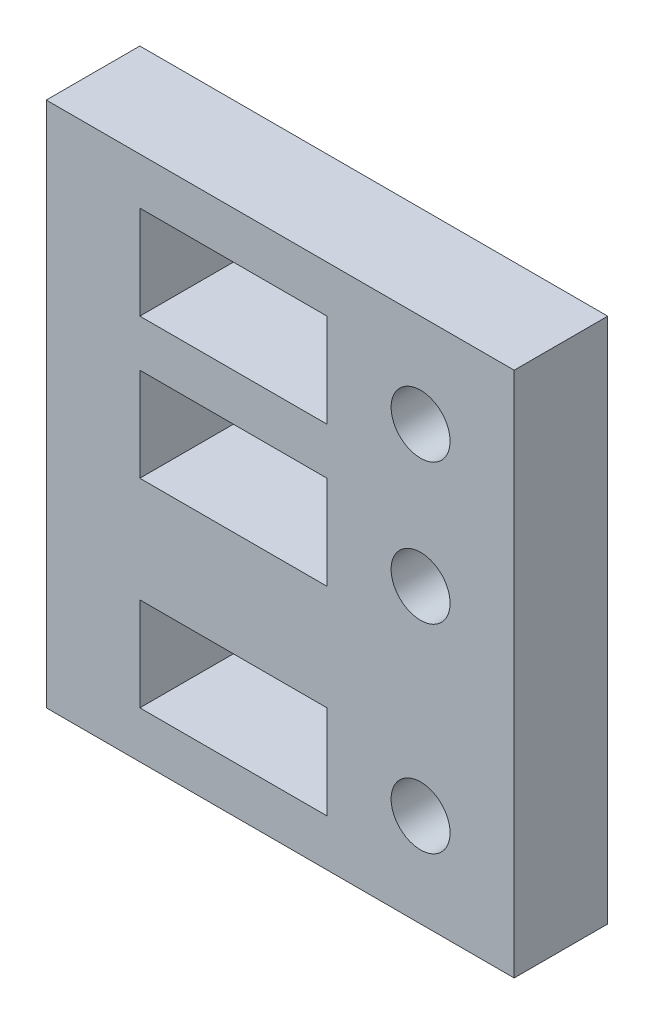
ISO-10303-21;
HEADER;
FILE_DESCRIPTION(('STEP AP214'),'2;1');
FILE_NAME('part.step','',(''),(''),'','','');
FILE_SCHEMA(('AUTOMOTIVE_DESIGN { 1 0 10303 214 1 1 1 1 }'));
ENDSEC;
DATA;
#1=APPLICATION_CONTEXT('core data for automotive mechanical design processes');
#2=APPLICATION_PROTOCOL_DEFINITION('international standard','automotive_design',2000,#1);
#3=PRODUCT_CONTEXT('',#1,'mechanical');
#4=PRODUCT('Part','Part','',(#3));
#5=PRODUCT_RELATED_PRODUCT_CATEGORY('part','',(#4));
#6=PRODUCT_DEFINITION_FORMATION('','',#4);
#7=PRODUCT_DEFINITION_CONTEXT('part definition',#1,'design');
#8=PRODUCT_DEFINITION('design','',#6,#7);
#9=PRODUCT_DEFINITION_SHAPE('','',#8);
#10=(LENGTH_UNIT() NAMED_UNIT(*) SI_UNIT(.MILLI.,.METRE.));
#11=(NAMED_UNIT(*) PLANE_ANGLE_UNIT() SI_UNIT($,.RADIAN.));
#12=(NAMED_UNIT(*) SI_UNIT($,.STERADIAN.) SOLID_ANGLE_UNIT());
#13=UNCERTAINTY_MEASURE_WITH_UNIT(LENGTH_MEASURE(1.E-05),#10,'distance_accuracy_value','');
#14=(GEOMETRIC_REPRESENTATION_CONTEXT(3) GLOBAL_UNCERTAINTY_ASSIGNED_CONTEXT((#13)) GLOBAL_UNIT_ASSIGNED_CONTEXT((#10,
#11,#12)) REPRESENTATION_CONTEXT('',''));
#15=CARTESIAN_POINT('',(0.,0.,0.));
#16=DIRECTION('',(0.,0.,1.));
#17=DIRECTION('',(1.,0.,0.));
#18=AXIS2_PLACEMENT_3D('',#15,#16,#17);
#19=CARTESIAN_POINT('',(0.,0.,-6.35));
#20=DIRECTION('',(0.,0.,1.));
#21=DIRECTION('',(-1.,0.,0.));
#22=AXIS2_PLACEMENT_3D('',#19,#20,#21);
#23=PLANE('',#22);
#24=CARTESIAN_POINT('',(25.4,6.35,-6.35));
#25=DIRECTION('',(0.,0.,1.));
#26=DIRECTION('',(1.,0.,0.));
#27=AXIS2_PLACEMENT_3D('',#24,#25,#26);
#28=CIRCLE('',#27,2.);
#29=CARTESIAN_POINT('',(27.4,6.35,-6.35));
#30=VERTEX_POINT('',#29);
#31=EDGE_CURVE('E187',#30,#30,#28,.T.);
#32=ORIENTED_EDGE('',*,*,#31,.T.);
#33=EDGE_LOOP('',(#32));
#34=FACE_BOUND('',#33,.T.);
#35=CARTESIAN_POINT('',(25.4,19.84375,-6.35));
#36=DIRECTION('',(0.,0.,1.));
#37=DIRECTION('',(1.,0.,0.));
#38=AXIS2_PLACEMENT_3D('',#35,#36,#37);
#39=CIRCLE('',#38,2.);
#40=CARTESIAN_POINT('',(27.4,19.84375,-6.35));
#41=VERTEX_POINT('',#40);
#42=EDGE_CURVE('E193',#41,#41,#39,.T.);
#43=ORIENTED_EDGE('',*,*,#42,.T.);
#44=EDGE_LOOP('',(#43));
#45=FACE_BOUND('',#44,.T.);
#46=DIRECTION('',(0.,-1.,0.));
#47=VECTOR('',#46,1.);
#48=CARTESIAN_POINT('',(6.35,9.525,-6.35));
#49=LINE('',#48,#47);
#50=CARTESIAN_POINT('',(6.35,9.525,-6.35));
#51=VERTEX_POINT('',#50);
#52=CARTESIAN_POINT('',(6.35,3.175,-6.35));
#53=VERTEX_POINT('',#52);
#54=EDGE_CURVE('E199',#51,#53,#49,.T.);
#55=ORIENTED_EDGE('',*,*,#54,.T.);
#56=DIRECTION('',(1.,0.,0.));
#57=VECTOR('',#56,1.);
#58=CARTESIAN_POINT('',(6.35,3.175,-6.35));
#59=LINE('',#58,#57);
#60=CARTESIAN_POINT('',(19.05,3.175,-6.35));
#61=VERTEX_POINT('',#60);
#62=EDGE_CURVE('E202',#53,#61,#59,.T.);
#63=ORIENTED_EDGE('',*,*,#62,.T.);
#64=DIRECTION('',(0.,1.,0.));
#65=VECTOR('',#64,1.);
#66=CARTESIAN_POINT('',(19.05,9.525,-6.35));
#67=LINE('',#66,#65);
#68=CARTESIAN_POINT('',(19.05,9.525,-6.35));
#69=VERTEX_POINT('',#68);
#70=EDGE_CURVE('E206',#61,#69,#67,.T.);
#71=ORIENTED_EDGE('',*,*,#70,.T.);
#72=DIRECTION('',(-1.,0.,0.));
#73=VECTOR('',#72,1.);
#74=CARTESIAN_POINT('',(6.35,9.525,-6.35));
#75=LINE('',#74,#73);
#76=EDGE_CURVE('E209',#69,#51,#75,.T.);
#77=ORIENTED_EDGE('',*,*,#76,.T.);
#78=EDGE_LOOP('',(#55,#63,#71,#77));
#79=FACE_BOUND('',#78,.T.);
#80=DIRECTION('',(0.,-1.,0.));
#81=VECTOR('',#80,1.);
#82=CARTESIAN_POINT('',(0.,0.,-6.35));
#83=LINE('',#82,#81);
#84=CARTESIAN_POINT('',(0.,35.71875,-6.35));
#85=VERTEX_POINT('',#84);
#86=CARTESIAN_POINT('',(0.,0.,-6.35));
#87=VERTEX_POINT('',#86);
#88=EDGE_CURVE('E263',#85,#87,#83,.T.);
#89=ORIENTED_EDGE('',*,*,#88,.F.);
#90=DIRECTION('',(-1.,0.,0.));
#91=VECTOR('',#90,1.);
#92=CARTESIAN_POINT('',(0.,35.71875,-6.35));
#93=LINE('',#92,#91);
#94=CARTESIAN_POINT('',(31.75,35.71875,-6.35));
#95=VERTEX_POINT('',#94);
#96=EDGE_CURVE('E273',#95,#85,#93,.T.);
#97=ORIENTED_EDGE('',*,*,#96,.F.);
#98=DIRECTION('',(0.,1.,0.));
#99=VECTOR('',#98,1.);
#100=CARTESIAN_POINT('',(31.75,0.,-6.35));
#101=LINE('',#100,#99);
#102=CARTESIAN_POINT('',(31.75,0.,-6.35));
#103=VERTEX_POINT('',#102);
#104=EDGE_CURVE('E270',#103,#95,#101,.T.);
#105=ORIENTED_EDGE('',*,*,#104,.F.);
#106=DIRECTION('',(1.,0.,0.));
#107=VECTOR('',#106,1.);
#108=CARTESIAN_POINT('',(0.,0.,-6.35));
#109=LINE('',#108,#107);
#110=EDGE_CURVE('E266',#87,#103,#109,.T.);
#111=ORIENTED_EDGE('',*,*,#110,.F.);
#112=EDGE_LOOP('',(#89,#97,#105,#111));
#113=FACE_BOUND('',#112,.T.);
#114=DIRECTION('',(0.,-1.,0.));
#115=VECTOR('',#114,1.);
#116=CARTESIAN_POINT('',(6.35,23.01875,-6.35));
#117=LINE('',#116,#115);
#118=CARTESIAN_POINT('',(6.35,23.01875,-6.35));
#119=VERTEX_POINT('',#118);
#120=CARTESIAN_POINT('',(6.35,16.66875,-6.35));
#121=VERTEX_POINT('',#120);
#122=EDGE_CURVE('E231',#119,#121,#117,.T.);
#123=ORIENTED_EDGE('',*,*,#122,.T.);
#124=DIRECTION('',(1.,0.,0.));
#125=VECTOR('',#124,1.);
#126=CARTESIAN_POINT('',(6.35,16.66875,-6.35));
#127=LINE('',#126,#125);
#128=CARTESIAN_POINT('',(19.05,16.66875,-6.35));
#129=VERTEX_POINT('',#128);
#130=EDGE_CURVE('E234',#121,#129,#127,.T.);
#131=ORIENTED_EDGE('',*,*,#130,.T.);
#132=DIRECTION('',(0.,1.,0.));
#133=VECTOR('',#132,1.);
#134=CARTESIAN_POINT('',(19.05,23.01875,-6.35));
#135=LINE('',#134,#133);
#136=CARTESIAN_POINT('',(19.05,23.01875,-6.35));
#137=VERTEX_POINT('',#136);
#138=EDGE_CURVE('E238',#129,#137,#135,.T.);
#139=ORIENTED_EDGE('',*,*,#138,.T.);
#140=DIRECTION('',(-1.,0.,0.));
#141=VECTOR('',#140,1.);
#142=CARTESIAN_POINT('',(6.35,23.01875,-6.35));
#143=LINE('',#142,#141);
#144=EDGE_CURVE('E241',#137,#119,#143,.T.);
#145=ORIENTED_EDGE('',*,*,#144,.T.);
#146=EDGE_LOOP('',(#123,#131,#139,#145));
#147=FACE_BOUND('',#146,.T.);
#148=DIRECTION('',(0.,1.,0.));
#149=VECTOR('',#148,1.);
#150=CARTESIAN_POINT('',(19.05,26.19375,-6.35));
#151=LINE('',#150,#149);
#152=CARTESIAN_POINT('',(19.05,26.19375,-6.35));
#153=VERTEX_POINT('',#152);
#154=CARTESIAN_POINT('',(19.05,32.54375,-6.35));
#155=VERTEX_POINT('',#154);
#156=EDGE_CURVE('E150',#153,#155,#151,.T.);
#157=ORIENTED_EDGE('',*,*,#156,.T.);
#158=DIRECTION('',(-1.,0.,0.));
#159=VECTOR('',#158,1.);
#160=CARTESIAN_POINT('',(6.35,32.54375,-6.35));
#161=LINE('',#160,#159);
#162=CARTESIAN_POINT('',(6.35,32.54375,-6.35));
#163=VERTEX_POINT('',#162);
#164=EDGE_CURVE('E159',#155,#163,#161,.T.);
#165=ORIENTED_EDGE('',*,*,#164,.T.);
#166=DIRECTION('',(0.,-1.,0.));
#167=VECTOR('',#166,1.);
#168=CARTESIAN_POINT('',(6.35,26.19375,-6.35));
#169=LINE('',#168,#167);
#170=CARTESIAN_POINT('',(6.35,26.19375,-6.35));
#171=VERTEX_POINT('',#170);
#172=EDGE_CURVE('E163',#163,#171,#169,.T.);
#173=ORIENTED_EDGE('',*,*,#172,.T.);
#174=DIRECTION('',(1.,0.,0.));
#175=VECTOR('',#174,1.);
#176=CARTESIAN_POINT('',(19.05,26.19375,-6.35));
#177=LINE('',#176,#175);
#178=EDGE_CURVE('E167',#171,#153,#177,.T.);
#179=ORIENTED_EDGE('',*,*,#178,.T.);
#180=EDGE_LOOP('',(#157,#165,#173,#179));
#181=FACE_BOUND('',#180,.T.);
#182=CARTESIAN_POINT('',(25.4,29.36875,-6.35));
#183=DIRECTION('',(0.,0.,1.));
#184=DIRECTION('',(1.,0.,0.));
#185=AXIS2_PLACEMENT_3D('',#182,#183,#184);
#186=CIRCLE('',#185,2.);
#187=CARTESIAN_POINT('',(27.4,29.36875,-6.35));
#188=VERTEX_POINT('',#187);
#189=EDGE_CURVE('E181',#188,#188,#186,.T.);
#190=ORIENTED_EDGE('',*,*,#189,.T.);
#191=EDGE_LOOP('',(#190));
#192=FACE_BOUND('',#191,.T.);
#193=ADVANCED_FACE('F35',(#34,#45,#79,#113,#147,#181,#192),#23,.F.);
#194=CARTESIAN_POINT('',(0.,0.,0.));
#195=DIRECTION('',(0.,0.,1.));
#196=DIRECTION('',(-1.,0.,0.));
#197=AXIS2_PLACEMENT_3D('',#194,#195,#196);
#198=PLANE('',#197);
#199=DIRECTION('',(1.,0.,0.));
#200=VECTOR('',#199,1.);
#201=CARTESIAN_POINT('',(19.05,26.19375,0.));
#202=LINE('',#201,#200);
#203=CARTESIAN_POINT('',(6.35,26.19375,0.));
#204=VERTEX_POINT('',#203);
#205=CARTESIAN_POINT('',(19.05,26.19375,0.));
#206=VERTEX_POINT('',#205);
#207=EDGE_CURVE('E168',#204,#206,#202,.T.);
#208=ORIENTED_EDGE('',*,*,#207,.F.);
#209=DIRECTION('',(0.,-1.,0.));
#210=VECTOR('',#209,1.);
#211=CARTESIAN_POINT('',(6.35,26.19375,0.));
#212=LINE('',#211,#210);
#213=CARTESIAN_POINT('',(6.35,32.54375,0.));
#214=VERTEX_POINT('',#213);
#215=EDGE_CURVE('E171',#214,#204,#212,.T.);
#216=ORIENTED_EDGE('',*,*,#215,.F.);
#217=DIRECTION('',(-1.,0.,0.));
#218=VECTOR('',#217,1.);
#219=CARTESIAN_POINT('',(6.35,32.54375,0.));
#220=LINE('',#219,#218);
#221=CARTESIAN_POINT('',(19.05,32.54375,0.));
#222=VERTEX_POINT('',#221);
#223=EDGE_CURVE('E180',#222,#214,#220,.T.);
#224=ORIENTED_EDGE('',*,*,#223,.F.);
#225=DIRECTION('',(0.,1.,0.));
#226=VECTOR('',#225,1.);
#227=CARTESIAN_POINT('',(19.05,26.19375,0.));
#228=LINE('',#227,#226);
#229=EDGE_CURVE('E151',#206,#222,#228,.T.);
#230=ORIENTED_EDGE('',*,*,#229,.F.);
#231=EDGE_LOOP('',(#208,#216,#224,#230));
#232=FACE_BOUND('',#231,.T.);
#233=CARTESIAN_POINT('',(25.4,6.35,0.));
#234=DIRECTION('',(0.,0.,1.));
#235=DIRECTION('',(1.,0.,0.));
#236=AXIS2_PLACEMENT_3D('',#233,#234,#235);
#237=CIRCLE('',#236,2.);
#238=CARTESIAN_POINT('',(27.4,6.35,0.));
#239=VERTEX_POINT('',#238);
#240=EDGE_CURVE('E155',#239,#239,#237,.T.);
#241=ORIENTED_EDGE('',*,*,#240,.F.);
#242=EDGE_LOOP('',(#241));
#243=FACE_BOUND('',#242,.T.);
#244=DIRECTION('',(-1.,0.,0.));
#245=VECTOR('',#244,1.);
#246=CARTESIAN_POINT('',(6.35,9.525,0.));
#247=LINE('',#246,#245);
#248=CARTESIAN_POINT('',(19.05,9.525,0.));
#249=VERTEX_POINT('',#248);
#250=CARTESIAN_POINT('',(6.35,9.525,0.));
#251=VERTEX_POINT('',#250);
#252=EDGE_CURVE('E203',#249,#251,#247,.T.);
#253=ORIENTED_EDGE('',*,*,#252,.F.);
#254=DIRECTION('',(0.,1.,0.));
#255=VECTOR('',#254,1.);
#256=CARTESIAN_POINT('',(19.05,9.525,0.));
#257=LINE('',#256,#255);
#258=CARTESIAN_POINT('',(19.05,3.175,0.));
#259=VERTEX_POINT('',#258);
#260=EDGE_CURVE('E218',#259,#249,#257,.T.);
#261=ORIENTED_EDGE('',*,*,#260,.F.);
#262=DIRECTION('',(1.,0.,0.));
#263=VECTOR('',#262,1.);
#264=CARTESIAN_POINT('',(6.35,3.175,0.));
#265=LINE('',#264,#263);
#266=CARTESIAN_POINT('',(6.35,3.175,0.));
#267=VERTEX_POINT('',#266);
#268=EDGE_CURVE('E215',#267,#259,#265,.T.);
#269=ORIENTED_EDGE('',*,*,#268,.F.);
#270=DIRECTION('',(0.,-1.,0.));
#271=VECTOR('',#270,1.);
#272=CARTESIAN_POINT('',(6.35,9.525,0.));
#273=LINE('',#272,#271);
#274=EDGE_CURVE('E196',#251,#267,#273,.T.);
#275=ORIENTED_EDGE('',*,*,#274,.F.);
#276=EDGE_LOOP('',(#253,#261,#269,#275));
#277=FACE_BOUND('',#276,.T.);
#278=DIRECTION('',(-1.,0.,0.));
#279=VECTOR('',#278,1.);
#280=CARTESIAN_POINT('',(6.35,23.01875,0.));
#281=LINE('',#280,#279);
#282=CARTESIAN_POINT('',(19.05,23.01875,0.));
#283=VERTEX_POINT('',#282);
#284=CARTESIAN_POINT('',(6.35,23.01875,0.));
#285=VERTEX_POINT('',#284);
#286=EDGE_CURVE('E235',#283,#285,#281,.T.);
#287=ORIENTED_EDGE('',*,*,#286,.F.);
#288=DIRECTION('',(0.,1.,0.));
#289=VECTOR('',#288,1.);
#290=CARTESIAN_POINT('',(19.05,23.01875,0.));
#291=LINE('',#290,#289);
#292=CARTESIAN_POINT('',(19.05,16.66875,0.));
#293=VERTEX_POINT('',#292);
#294=EDGE_CURVE('E250',#293,#283,#291,.T.);
#295=ORIENTED_EDGE('',*,*,#294,.F.);
#296=DIRECTION('',(1.,0.,0.));
#297=VECTOR('',#296,1.);
#298=CARTESIAN_POINT('',(6.35,16.66875,0.));
#299=LINE('',#298,#297);
#300=CARTESIAN_POINT('',(6.35,16.66875,0.));
#301=VERTEX_POINT('',#300);
#302=EDGE_CURVE('E247',#301,#293,#299,.T.);
#303=ORIENTED_EDGE('',*,*,#302,.F.);
#304=DIRECTION('',(0.,-1.,0.));
#305=VECTOR('',#304,1.);
#306=CARTESIAN_POINT('',(6.35,23.01875,0.));
#307=LINE('',#306,#305);
#308=EDGE_CURVE('E230',#285,#301,#307,.T.);
#309=ORIENTED_EDGE('',*,*,#308,.F.);
#310=EDGE_LOOP('',(#287,#295,#303,#309));
#311=FACE_BOUND('',#310,.T.);
#312=DIRECTION('',(1.,0.,0.));
#313=VECTOR('',#312,1.);
#314=CARTESIAN_POINT('',(0.,0.,0.));
#315=LINE('',#314,#313);
#316=CARTESIAN_POINT('',(0.,0.,0.));
#317=VERTEX_POINT('',#316);
#318=CARTESIAN_POINT('',(31.75,0.,0.));
#319=VERTEX_POINT('',#318);
#320=EDGE_CURVE('E262',#317,#319,#315,.T.);
#321=ORIENTED_EDGE('',*,*,#320,.T.);
#322=DIRECTION('',(0.,1.,0.));
#323=VECTOR('',#322,1.);
#324=CARTESIAN_POINT('',(31.75,35.71875,0.));
#325=LINE('',#324,#323);
#326=CARTESIAN_POINT('',(31.75,35.71875,0.));
#327=VERTEX_POINT('',#326);
#328=EDGE_CURVE('E279',#319,#327,#325,.T.);
#329=ORIENTED_EDGE('',*,*,#328,.T.);
#330=DIRECTION('',(-1.,0.,0.));
#331=VECTOR('',#330,1.);
#332=CARTESIAN_POINT('',(0.,35.71875,0.));
#333=LINE('',#332,#331);
#334=CARTESIAN_POINT('',(0.,35.71875,0.));
#335=VERTEX_POINT('',#334);
#336=EDGE_CURVE('E282',#327,#335,#333,.T.);
#337=ORIENTED_EDGE('',*,*,#336,.T.);
#338=DIRECTION('',(0.,-1.,0.));
#339=VECTOR('',#338,1.);
#340=CARTESIAN_POINT('',(0.,35.71875,0.));
#341=LINE('',#340,#339);
#342=EDGE_CURVE('E267',#335,#317,#341,.T.);
#343=ORIENTED_EDGE('',*,*,#342,.T.);
#344=EDGE_LOOP('',(#321,#329,#337,#343));
#345=FACE_BOUND('',#344,.T.);
#346=CARTESIAN_POINT('',(25.4,19.84375,0.));
#347=DIRECTION('',(0.,0.,1.));
#348=DIRECTION('',(1.,0.,0.));
#349=AXIS2_PLACEMENT_3D('',#346,#347,#348);
#350=CIRCLE('',#349,2.);
#351=CARTESIAN_POINT('',(27.4,19.84375,0.));
#352=VERTEX_POINT('',#351);
#353=EDGE_CURVE('E190',#352,#352,#350,.T.);
#354=ORIENTED_EDGE('',*,*,#353,.F.);
#355=EDGE_LOOP('',(#354));
#356=FACE_BOUND('',#355,.T.);
#357=CARTESIAN_POINT('',(25.4,29.36875,0.));
#358=DIRECTION('',(0.,0.,1.));
#359=DIRECTION('',(1.,0.,0.));
#360=AXIS2_PLACEMENT_3D('',#357,#358,#359);
#361=CIRCLE('',#360,2.);
#362=CARTESIAN_POINT('',(27.4,29.36875,0.));
#363=VERTEX_POINT('',#362);
#364=EDGE_CURVE('E174',#363,#363,#361,.T.);
#365=ORIENTED_EDGE('',*,*,#364,.F.);
#366=EDGE_LOOP('',(#365));
#367=FACE_BOUND('',#366,.T.);
#368=ADVANCED_FACE('F298',(#232,#243,#277,#311,#345,#356,#367),#198,.T.);
#369=CARTESIAN_POINT('',(0.,0.,-6.35));
#370=DIRECTION('',(0.,1.,0.));
#371=DIRECTION('',(0.,0.,-1.));
#372=AXIS2_PLACEMENT_3D('',#369,#370,#371);
#373=PLANE('',#372);
#374=ORIENTED_EDGE('',*,*,#320,.F.);
#375=DIRECTION('',(0.,0.,1.));
#376=VECTOR('',#375,1.);
#377=CARTESIAN_POINT('',(0.,0.,-6.35));
#378=LINE('',#377,#376);
#379=EDGE_CURVE('E11',#87,#317,#378,.T.);
#380=ORIENTED_EDGE('',*,*,#379,.F.);
#381=ORIENTED_EDGE('',*,*,#110,.T.);
#382=DIRECTION('',(0.,0.,1.));
#383=VECTOR('',#382,1.);
#384=CARTESIAN_POINT('',(31.75,0.,-6.35));
#385=LINE('',#384,#383);
#386=EDGE_CURVE('E43',#103,#319,#385,.T.);
#387=ORIENTED_EDGE('',*,*,#386,.T.);
#388=EDGE_LOOP('',(#374,#380,#381,#387));
#389=FACE_BOUND('',#388,.T.);
#390=ADVANCED_FACE('F37',(#389),#373,.F.);
#391=CARTESIAN_POINT('',(31.75,35.71875,-6.35));
#392=DIRECTION('',(-1.,0.,0.));
#393=DIRECTION('',(0.,0.,-1.));
#394=AXIS2_PLACEMENT_3D('',#391,#392,#393);
#395=PLANE('',#394);
#396=ORIENTED_EDGE('',*,*,#328,.F.);
#397=ORIENTED_EDGE('',*,*,#386,.F.);
#398=ORIENTED_EDGE('',*,*,#104,.T.);
#399=DIRECTION('',(0.,0.,1.));
#400=VECTOR('',#399,1.);
#401=CARTESIAN_POINT('',(31.75,35.71875,-6.35));
#402=LINE('',#401,#400);
#403=EDGE_CURVE('E288',#95,#327,#402,.T.);
#404=ORIENTED_EDGE('',*,*,#403,.T.);
#405=EDGE_LOOP('',(#396,#397,#398,#404));
#406=FACE_BOUND('',#405,.T.);
#407=ADVANCED_FACE('F295',(#406),#395,.F.);
#408=CARTESIAN_POINT('',(0.,35.71875,-6.35));
#409=DIRECTION('',(0.,-1.,0.));
#410=DIRECTION('',(0.,0.,1.));
#411=AXIS2_PLACEMENT_3D('',#408,#409,#410);
#412=PLANE('',#411);
#413=ORIENTED_EDGE('',*,*,#336,.F.);
#414=ORIENTED_EDGE('',*,*,#403,.F.);
#415=ORIENTED_EDGE('',*,*,#96,.T.);
#416=DIRECTION('',(0.,0.,1.));
#417=VECTOR('',#416,1.);
#418=CARTESIAN_POINT('',(0.,35.71875,-6.35));
#419=LINE('',#418,#417);
#420=EDGE_CURVE('E276',#85,#335,#419,.T.);
#421=ORIENTED_EDGE('',*,*,#420,.T.);
#422=EDGE_LOOP('',(#413,#414,#415,#421));
#423=FACE_BOUND('',#422,.T.);
#424=ADVANCED_FACE('F308',(#423),#412,.F.);
#425=CARTESIAN_POINT('',(0.,35.71875,-6.35));
#426=DIRECTION('',(1.,0.,0.));
#427=DIRECTION('',(0.,0.,1.));
#428=AXIS2_PLACEMENT_3D('',#425,#426,#427);
#429=PLANE('',#428);
#430=ORIENTED_EDGE('',*,*,#342,.F.);
#431=ORIENTED_EDGE('',*,*,#420,.F.);
#432=ORIENTED_EDGE('',*,*,#88,.T.);
#433=ORIENTED_EDGE('',*,*,#379,.T.);
#434=EDGE_LOOP('',(#430,#431,#432,#433));
#435=FACE_BOUND('',#434,.T.);
#436=ADVANCED_FACE('F302',(#435),#429,.F.);
#437=CARTESIAN_POINT('',(6.35,23.01875,-6.35));
#438=DIRECTION('',(1.,0.,0.));
#439=DIRECTION('',(0.,0.,1.));
#440=AXIS2_PLACEMENT_3D('',#437,#438,#439);
#441=PLANE('',#440);
#442=ORIENTED_EDGE('',*,*,#308,.T.);
#443=DIRECTION('',(0.,0.,1.));
#444=VECTOR('',#443,1.);
#445=CARTESIAN_POINT('',(6.35,16.66875,-6.35));
#446=LINE('',#445,#444);
#447=EDGE_CURVE('E260',#121,#301,#446,.T.);
#448=ORIENTED_EDGE('',*,*,#447,.F.);
#449=ORIENTED_EDGE('',*,*,#122,.F.);
#450=DIRECTION('',(0.,0.,1.));
#451=VECTOR('',#450,1.);
#452=CARTESIAN_POINT('',(6.35,23.01875,-6.35));
#453=LINE('',#452,#451);
#454=EDGE_CURVE('E244',#119,#285,#453,.T.);
#455=ORIENTED_EDGE('',*,*,#454,.T.);
#456=EDGE_LOOP('',(#442,#448,#449,#455));
#457=FACE_BOUND('',#456,.T.);
#458=ADVANCED_FACE('F315',(#457),#441,.T.);
#459=CARTESIAN_POINT('',(6.35,16.66875,-6.35));
#460=DIRECTION('',(0.,1.,0.));
#461=DIRECTION('',(0.,0.,-1.));
#462=AXIS2_PLACEMENT_3D('',#459,#460,#461);
#463=PLANE('',#462);
#464=ORIENTED_EDGE('',*,*,#302,.T.);
#465=DIRECTION('',(0.,0.,1.));
#466=VECTOR('',#465,1.);
#467=CARTESIAN_POINT('',(19.05,16.66875,-6.35));
#468=LINE('',#467,#466);
#469=EDGE_CURVE('E258',#129,#293,#468,.T.);
#470=ORIENTED_EDGE('',*,*,#469,.F.);
#471=ORIENTED_EDGE('',*,*,#130,.F.);
#472=ORIENTED_EDGE('',*,*,#447,.T.);
#473=EDGE_LOOP('',(#464,#470,#471,#472));
#474=FACE_BOUND('',#473,.T.);
#475=ADVANCED_FACE('F329',(#474),#463,.T.);
#476=CARTESIAN_POINT('',(19.05,23.01875,-6.35));
#477=DIRECTION('',(-1.,0.,0.));
#478=DIRECTION('',(0.,0.,-1.));
#479=AXIS2_PLACEMENT_3D('',#476,#477,#478);
#480=PLANE('',#479);
#481=ORIENTED_EDGE('',*,*,#294,.T.);
#482=DIRECTION('',(0.,0.,1.));
#483=VECTOR('',#482,1.);
#484=CARTESIAN_POINT('',(19.05,23.01875,-6.35));
#485=LINE('',#484,#483);
#486=EDGE_CURVE('E256',#137,#283,#485,.T.);
#487=ORIENTED_EDGE('',*,*,#486,.F.);
#488=ORIENTED_EDGE('',*,*,#138,.F.);
#489=ORIENTED_EDGE('',*,*,#469,.T.);
#490=EDGE_LOOP('',(#481,#487,#488,#489));
#491=FACE_BOUND('',#490,.T.);
#492=ADVANCED_FACE('F333',(#491),#480,.T.);
#493=CARTESIAN_POINT('',(6.35,23.01875,-6.35));
#494=DIRECTION('',(0.,-1.,0.));
#495=DIRECTION('',(0.,0.,1.));
#496=AXIS2_PLACEMENT_3D('',#493,#494,#495);
#497=PLANE('',#496);
#498=ORIENTED_EDGE('',*,*,#286,.T.);
#499=ORIENTED_EDGE('',*,*,#454,.F.);
#500=ORIENTED_EDGE('',*,*,#144,.F.);
#501=ORIENTED_EDGE('',*,*,#486,.T.);
#502=EDGE_LOOP('',(#498,#499,#500,#501));
#503=FACE_BOUND('',#502,.T.);
#504=ADVANCED_FACE('F337',(#503),#497,.T.);
#505=CARTESIAN_POINT('',(6.35,9.525,-6.35));
#506=DIRECTION('',(1.,0.,0.));
#507=DIRECTION('',(0.,1.,0.));
#508=AXIS2_PLACEMENT_3D('',#505,#506,#507);
#509=PLANE('',#508);
#510=ORIENTED_EDGE('',*,*,#274,.T.);
#511=DIRECTION('',(0.,0.,1.));
#512=VECTOR('',#511,1.);
#513=CARTESIAN_POINT('',(6.35,3.175,-6.35));
#514=LINE('',#513,#512);
#515=EDGE_CURVE('E228',#53,#267,#514,.T.);
#516=ORIENTED_EDGE('',*,*,#515,.F.);
#517=ORIENTED_EDGE('',*,*,#54,.F.);
#518=DIRECTION('',(0.,0.,1.));
#519=VECTOR('',#518,1.);
#520=CARTESIAN_POINT('',(6.35,9.525,-6.35));
#521=LINE('',#520,#519);
#522=EDGE_CURVE('E212',#51,#251,#521,.T.);
#523=ORIENTED_EDGE('',*,*,#522,.T.);
#524=EDGE_LOOP('',(#510,#516,#517,#523));
#525=FACE_BOUND('',#524,.T.);
#526=ADVANCED_FACE('F341',(#525),#509,.T.);
#527=CARTESIAN_POINT('',(6.35,3.175,-6.35));
#528=DIRECTION('',(0.,1.,0.));
#529=DIRECTION('',(0.,0.,-1.));
#530=AXIS2_PLACEMENT_3D('',#527,#528,#529);
#531=PLANE('',#530);
#532=ORIENTED_EDGE('',*,*,#268,.T.);
#533=DIRECTION('',(0.,0.,1.));
#534=VECTOR('',#533,1.);
#535=CARTESIAN_POINT('',(19.05,3.175,-6.35));
#536=LINE('',#535,#534);
#537=EDGE_CURVE('E226',#61,#259,#536,.T.);
#538=ORIENTED_EDGE('',*,*,#537,.F.);
#539=ORIENTED_EDGE('',*,*,#62,.F.);
#540=ORIENTED_EDGE('',*,*,#515,.T.);
#541=EDGE_LOOP('',(#532,#538,#539,#540));
#542=FACE_BOUND('',#541,.T.);
#543=ADVANCED_FACE('F345',(#542),#531,.T.);
#544=CARTESIAN_POINT('',(19.05,9.525,-6.35));
#545=DIRECTION('',(-1.,0.,0.));
#546=DIRECTION('',(0.,0.,-1.));
#547=AXIS2_PLACEMENT_3D('',#544,#545,#546);
#548=PLANE('',#547);
#549=ORIENTED_EDGE('',*,*,#260,.T.);
#550=DIRECTION('',(0.,0.,1.));
#551=VECTOR('',#550,1.);
#552=CARTESIAN_POINT('',(19.05,9.525,-6.35));
#553=LINE('',#552,#551);
#554=EDGE_CURVE('E224',#69,#249,#553,.T.);
#555=ORIENTED_EDGE('',*,*,#554,.F.);
#556=ORIENTED_EDGE('',*,*,#70,.F.);
#557=ORIENTED_EDGE('',*,*,#537,.T.);
#558=EDGE_LOOP('',(#549,#555,#556,#557));
#559=FACE_BOUND('',#558,.T.);
#560=ADVANCED_FACE('F349',(#559),#548,.T.);
#561=CARTESIAN_POINT('',(6.35,9.525,-6.35));
#562=DIRECTION('',(0.,-1.,0.));
#563=DIRECTION('',(0.,0.,1.));
#564=AXIS2_PLACEMENT_3D('',#561,#562,#563);
#565=PLANE('',#564);
#566=ORIENTED_EDGE('',*,*,#252,.T.);
#567=ORIENTED_EDGE('',*,*,#522,.F.);
#568=ORIENTED_EDGE('',*,*,#76,.F.);
#569=ORIENTED_EDGE('',*,*,#554,.T.);
#570=EDGE_LOOP('',(#566,#567,#568,#569));
#571=FACE_BOUND('',#570,.T.);
#572=ADVANCED_FACE('F353',(#571),#565,.T.);
#573=CARTESIAN_POINT('',(25.4,19.84375,-6.35));
#574=DIRECTION('',(0.,0.,1.));
#575=DIRECTION('',(-1.,0.,0.));
#576=AXIS2_PLACEMENT_3D('',#573,#574,#575);
#577=CYLINDRICAL_SURFACE('',#576,2.);
#578=ORIENTED_EDGE('',*,*,#42,.F.);
#579=EDGE_LOOP('',(#578));
#580=FACE_BOUND('',#579,.T.);
#581=ORIENTED_EDGE('',*,*,#353,.T.);
#582=EDGE_LOOP('',(#581));
#583=FACE_BOUND('',#582,.T.);
#584=ADVANCED_FACE('F357',(#580,#583),#577,.F.);
#585=CARTESIAN_POINT('',(25.4,6.35,-6.35));
#586=DIRECTION('',(0.,0.,1.));
#587=DIRECTION('',(-1.,0.,0.));
#588=AXIS2_PLACEMENT_3D('',#585,#586,#587);
#589=CYLINDRICAL_SURFACE('',#588,2.);
#590=ORIENTED_EDGE('',*,*,#31,.F.);
#591=EDGE_LOOP('',(#590));
#592=FACE_BOUND('',#591,.T.);
#593=ORIENTED_EDGE('',*,*,#240,.T.);
#594=EDGE_LOOP('',(#593));
#595=FACE_BOUND('',#594,.T.);
#596=ADVANCED_FACE('F361',(#592,#595),#589,.F.);
#597=CARTESIAN_POINT('',(19.05,26.19375,-6.35));
#598=DIRECTION('',(-1.,0.,0.));
#599=DIRECTION('',(0.,-1.,0.));
#600=AXIS2_PLACEMENT_3D('',#597,#598,#599);
#601=PLANE('',#600);
#602=ORIENTED_EDGE('',*,*,#229,.T.);
#603=DIRECTION('',(0.,0.,1.));
#604=VECTOR('',#603,1.);
#605=CARTESIAN_POINT('',(19.05,32.54375,-6.35));
#606=LINE('',#605,#604);
#607=EDGE_CURVE('E146',#155,#222,#606,.T.);
#608=ORIENTED_EDGE('',*,*,#607,.F.);
#609=ORIENTED_EDGE('',*,*,#156,.F.);
#610=DIRECTION('',(0.,0.,1.));
#611=VECTOR('',#610,1.);
#612=CARTESIAN_POINT('',(19.05,26.19375,-6.35));
#613=LINE('',#612,#611);
#614=EDGE_CURVE('E58',#153,#206,#613,.T.);
#615=ORIENTED_EDGE('',*,*,#614,.T.);
#616=EDGE_LOOP('',(#602,#608,#609,#615));
#617=FACE_BOUND('',#616,.T.);
#618=ADVANCED_FACE('F148',(#617),#601,.T.);
#619=CARTESIAN_POINT('',(6.35,32.54375,-6.35));
#620=DIRECTION('',(0.,-1.,0.));
#621=DIRECTION('',(1.,0.,0.));
#622=AXIS2_PLACEMENT_3D('',#619,#620,#621);
#623=PLANE('',#622);
#624=ORIENTED_EDGE('',*,*,#223,.T.);
#625=DIRECTION('',(0.,0.,1.));
#626=VECTOR('',#625,1.);
#627=CARTESIAN_POINT('',(6.35,32.54375,-6.35));
#628=LINE('',#627,#626);
#629=EDGE_CURVE('E156',#163,#214,#628,.T.);
#630=ORIENTED_EDGE('',*,*,#629,.F.);
#631=ORIENTED_EDGE('',*,*,#164,.F.);
#632=ORIENTED_EDGE('',*,*,#607,.T.);
#633=EDGE_LOOP('',(#624,#630,#631,#632));
#634=FACE_BOUND('',#633,.T.);
#635=ADVANCED_FACE('F160',(#634),#623,.T.);
#636=CARTESIAN_POINT('',(6.35,26.19375,-6.35));
#637=DIRECTION('',(1.,0.,0.));
#638=DIRECTION('',(0.,0.,1.));
#639=AXIS2_PLACEMENT_3D('',#636,#637,#638);
#640=PLANE('',#639);
#641=ORIENTED_EDGE('',*,*,#215,.T.);
#642=DIRECTION('',(0.,0.,1.));
#643=VECTOR('',#642,1.);
#644=CARTESIAN_POINT('',(6.35,26.19375,-6.35));
#645=LINE('',#644,#643);
#646=EDGE_CURVE('E50',#171,#204,#645,.T.);
#647=ORIENTED_EDGE('',*,*,#646,.F.);
#648=ORIENTED_EDGE('',*,*,#172,.F.);
#649=ORIENTED_EDGE('',*,*,#629,.T.);
#650=EDGE_LOOP('',(#641,#647,#648,#649));
#651=FACE_BOUND('',#650,.T.);
#652=ADVANCED_FACE('F370',(#651),#640,.T.);
#653=CARTESIAN_POINT('',(19.05,26.19375,-6.35));
#654=DIRECTION('',(0.,1.,0.));
#655=DIRECTION('',(0.,0.,-1.));
#656=AXIS2_PLACEMENT_3D('',#653,#654,#655);
#657=PLANE('',#656);
#658=ORIENTED_EDGE('',*,*,#207,.T.);
#659=ORIENTED_EDGE('',*,*,#614,.F.);
#660=ORIENTED_EDGE('',*,*,#178,.F.);
#661=ORIENTED_EDGE('',*,*,#646,.T.);
#662=EDGE_LOOP('',(#658,#659,#660,#661));
#663=FACE_BOUND('',#662,.T.);
#664=ADVANCED_FACE('F373',(#663),#657,.T.);
#665=CARTESIAN_POINT('',(25.4,29.36875,-6.35));
#666=DIRECTION('',(0.,0.,1.));
#667=DIRECTION('',(-1.,0.,0.));
#668=AXIS2_PLACEMENT_3D('',#665,#666,#667);
#669=CYLINDRICAL_SURFACE('',#668,2.);
#670=ORIENTED_EDGE('',*,*,#189,.F.);
#671=EDGE_LOOP('',(#670));
#672=FACE_BOUND('',#671,.T.);
#673=ORIENTED_EDGE('',*,*,#364,.T.);
#674=EDGE_LOOP('',(#673));
#675=FACE_BOUND('',#674,.T.);
#676=ADVANCED_FACE('F376',(#672,#675),#669,.F.);
#677=CLOSED_SHELL('',(#193,#368,#390,#407,#424,#436,#458,#475,#492,#504,#526,#543,#560,#572,
#584,#596,#618,#635,#652,#664,#676));
#678=MANIFOLD_SOLID_BREP('B2',#677);
#679=ADVANCED_BREP_SHAPE_REPRESENTATION('',(#18,#678),#14);
#680=SHAPE_DEFINITION_REPRESENTATION(#9,#679);
ENDSEC;
END-ISO-10303-21;
